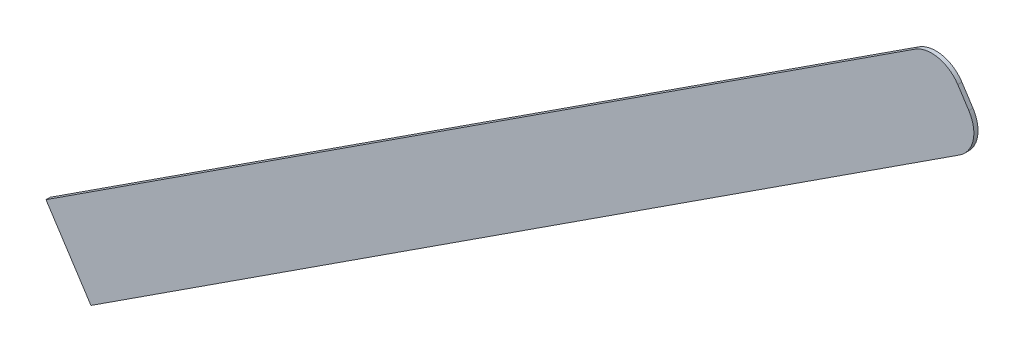
ISO-10303-21;
HEADER;
FILE_DESCRIPTION(('STEP AP214'),'2;1');
FILE_NAME('part.step','',(''),(''),'','','');
FILE_SCHEMA(('AUTOMOTIVE_DESIGN { 1 0 10303 214 1 1 1 1 }'));
ENDSEC;
DATA;
#1=APPLICATION_CONTEXT('core data for automotive mechanical design processes');
#2=APPLICATION_PROTOCOL_DEFINITION('international standard','automotive_design',2000,#1);
#3=PRODUCT_CONTEXT('',#1,'mechanical');
#4=PRODUCT('Part','Part','',(#3));
#5=PRODUCT_RELATED_PRODUCT_CATEGORY('part','',(#4));
#6=PRODUCT_DEFINITION_FORMATION('','',#4);
#7=PRODUCT_DEFINITION_CONTEXT('part definition',#1,'design');
#8=PRODUCT_DEFINITION('design','',#6,#7);
#9=PRODUCT_DEFINITION_SHAPE('','',#8);
#10=(LENGTH_UNIT() NAMED_UNIT(*) SI_UNIT(.MILLI.,.METRE.));
#11=(NAMED_UNIT(*) PLANE_ANGLE_UNIT() SI_UNIT($,.RADIAN.));
#12=(NAMED_UNIT(*) SI_UNIT($,.STERADIAN.) SOLID_ANGLE_UNIT());
#13=UNCERTAINTY_MEASURE_WITH_UNIT(LENGTH_MEASURE(1.E-05),#10,'distance_accuracy_value','');
#14=(GEOMETRIC_REPRESENTATION_CONTEXT(3) GLOBAL_UNCERTAINTY_ASSIGNED_CONTEXT((#13)) GLOBAL_UNIT_ASSIGNED_CONTEXT((#10,
#11,#12)) REPRESENTATION_CONTEXT('',''));
#15=CARTESIAN_POINT('',(0.,0.,0.));
#16=DIRECTION('',(0.,0.,1.));
#17=DIRECTION('',(1.,0.,0.));
#18=AXIS2_PLACEMENT_3D('',#15,#16,#17);
#19=CARTESIAN_POINT('',(79.4688535728897,52.7674489918808,2.));
#20=DIRECTION('',(0.,0.,-1.));
#21=DIRECTION('',(-1.,0.,0.));
#22=AXIS2_PLACEMENT_3D('',#19,#20,#21);
#23=CYLINDRICAL_SURFACE('',#22,15.);
#24=CARTESIAN_POINT('',(79.4688535728897,52.7674489918808,0.));
#25=DIRECTION('',(0.,0.,1.));
#26=DIRECTION('',(-1.,0.,0.));
#27=AXIS2_PLACEMENT_3D('',#24,#25,#26);
#28=CIRCLE('',#27,15.);
#29=CARTESIAN_POINT('',(92.0455078173995,60.9422742508116,0.));
#30=VERTEX_POINT('',#29);
#31=CARTESIAN_POINT('',(71.2940283139584,65.3441032363903,0.));
#32=VERTEX_POINT('',#31);
#33=EDGE_CURVE('E117',#30,#32,#28,.T.);
#34=ORIENTED_EDGE('',*,*,#33,.T.);
#35=DIRECTION('',(0.,0.,-1.));
#36=VECTOR('',#35,1.);
#37=CARTESIAN_POINT('',(71.2940283139584,65.3441032363903,2.));
#38=LINE('',#37,#36);
#39=CARTESIAN_POINT('',(71.2940283139584,65.3441032363903,2.));
#40=VERTEX_POINT('',#39);
#41=EDGE_CURVE('E11',#40,#32,#38,.T.);
#42=ORIENTED_EDGE('',*,*,#41,.F.);
#43=CARTESIAN_POINT('',(79.4688535728897,52.7674489918808,2.));
#44=DIRECTION('',(0.,0.,1.));
#45=DIRECTION('',(-1.,0.,0.));
#46=AXIS2_PLACEMENT_3D('',#43,#44,#45);
#47=CIRCLE('',#46,15.);
#48=CARTESIAN_POINT('',(92.0455078173995,60.9422742508116,2.));
#49=VERTEX_POINT('',#48);
#50=EDGE_CURVE('E127',#49,#40,#47,.T.);
#51=ORIENTED_EDGE('',*,*,#50,.F.);
#52=DIRECTION('',(0.,0.,-1.));
#53=VECTOR('',#52,1.);
#54=CARTESIAN_POINT('',(92.0455078173995,60.9422742508116,2.));
#55=LINE('',#54,#53);
#56=EDGE_CURVE('E113',#49,#30,#55,.T.);
#57=ORIENTED_EDGE('',*,*,#56,.T.);
#58=EDGE_LOOP('',(#34,#42,#51,#57));
#59=FACE_BOUND('',#58,.T.);
#60=ADVANCED_FACE('F33',(#59),#23,.T.);
#61=CARTESIAN_POINT('',(-347.92777983636,-207.150072061318,2.));
#62=DIRECTION('',(0.544988350595416,-0.838443616300636,0.));
#63=DIRECTION('',(0.838443616300636,0.544988350595416,0.));
#64=AXIS2_PLACEMENT_3D('',#61,#62,#63);
#65=PLANE('',#64);
#66=DIRECTION('',(-0.838443616300636,-0.544988350595416,0.));
#67=VECTOR('',#66,1.);
#68=CARTESIAN_POINT('',(-347.92777983636,-207.150072061318,0.));
#69=LINE('',#68,#67);
#70=CARTESIAN_POINT('',(-347.92777983636,-207.150072061318,0.));
#71=VERTEX_POINT('',#70);
#72=EDGE_CURVE('E120',#32,#71,#69,.T.);
#73=ORIENTED_EDGE('',*,*,#72,.T.);
#74=DIRECTION('',(0.,0.,-1.));
#75=VECTOR('',#74,1.);
#76=CARTESIAN_POINT('',(-347.92777983636,-207.150072061318,2.));
#77=LINE('',#76,#75);
#78=CARTESIAN_POINT('',(-347.92777983636,-207.150072061318,2.));
#79=VERTEX_POINT('',#78);
#80=EDGE_CURVE('E41',#79,#71,#77,.T.);
#81=ORIENTED_EDGE('',*,*,#80,.F.);
#82=DIRECTION('',(-0.838443616300636,-0.544988350595416,0.));
#83=VECTOR('',#82,1.);
#84=CARTESIAN_POINT('',(-347.92777983636,-207.150072061318,2.));
#85=LINE('',#84,#83);
#86=EDGE_CURVE('E86',#40,#79,#85,.T.);
#87=ORIENTED_EDGE('',*,*,#86,.F.);
#88=ORIENTED_EDGE('',*,*,#41,.T.);
#89=EDGE_LOOP('',(#73,#81,#87,#88));
#90=FACE_BOUND('',#89,.T.);
#91=ADVANCED_FACE('F151',(#90),#65,.F.);
#92=CARTESIAN_POINT('',(-347.92777983636,-207.150072061318,2.));
#93=DIRECTION('',(0.838443616300637,0.544988350595415,0.));
#94=DIRECTION('',(-0.544988350595415,0.838443616300637,0.));
#95=AXIS2_PLACEMENT_3D('',#92,#93,#94);
#96=PLANE('',#95);
#97=DIRECTION('',(0.544988350595415,-0.838443616300637,0.));
#98=VECTOR('',#97,1.);
#99=CARTESIAN_POINT('',(-347.92777983636,-207.150072061318,0.));
#100=LINE('',#99,#98);
#101=CARTESIAN_POINT('',(-326.237243482662,-240.520127990083,0.));
#102=VERTEX_POINT('',#101);
#103=EDGE_CURVE('E122',#71,#102,#100,.T.);
#104=ORIENTED_EDGE('',*,*,#103,.T.);
#105=DIRECTION('',(0.,0.,-1.));
#106=VECTOR('',#105,1.);
#107=CARTESIAN_POINT('',(-326.237243482662,-240.520127990083,2.));
#108=LINE('',#107,#106);
#109=CARTESIAN_POINT('',(-326.237243482662,-240.520127990083,2.));
#110=VERTEX_POINT('',#109);
#111=EDGE_CURVE('E108',#110,#102,#108,.T.);
#112=ORIENTED_EDGE('',*,*,#111,.F.);
#113=DIRECTION('',(0.544988350595415,-0.838443616300637,0.));
#114=VECTOR('',#113,1.);
#115=CARTESIAN_POINT('',(-347.92777983636,-207.150072061318,2.));
#116=LINE('',#115,#114);
#117=EDGE_CURVE('E99',#79,#110,#116,.T.);
#118=ORIENTED_EDGE('',*,*,#117,.F.);
#119=ORIENTED_EDGE('',*,*,#80,.T.);
#120=EDGE_LOOP('',(#104,#112,#118,#119));
#121=FACE_BOUND('',#120,.T.);
#122=ADVANCED_FACE('F133',(#121),#96,.F.);
#123=CARTESIAN_POINT('',(-326.237243482662,-240.520127990083,2.));
#124=DIRECTION('',(-0.544988350595416,0.838443616300636,0.));
#125=DIRECTION('',(-0.838443616300636,-0.544988350595416,0.));
#126=AXIS2_PLACEMENT_3D('',#123,#124,#125);
#127=PLANE('',#126);
#128=DIRECTION('',(0.838443616300636,0.544988350595416,0.));
#129=VECTOR('',#128,1.);
#130=CARTESIAN_POINT('',(-326.237243482662,-240.520127990083,0.));
#131=LINE('',#130,#129);
#132=CARTESIAN_POINT('',(92.9845646676559,31.974047307625,0.));
#133=VERTEX_POINT('',#132);
#134=EDGE_CURVE('E107',#102,#133,#131,.T.);
#135=ORIENTED_EDGE('',*,*,#134,.T.);
#136=DIRECTION('',(0.,0.,-1.));
#137=VECTOR('',#136,1.);
#138=CARTESIAN_POINT('',(92.9845646676559,31.974047307625,2.));
#139=LINE('',#138,#137);
#140=CARTESIAN_POINT('',(92.9845646676559,31.974047307625,2.));
#141=VERTEX_POINT('',#140);
#142=EDGE_CURVE('E104',#141,#133,#139,.T.);
#143=ORIENTED_EDGE('',*,*,#142,.F.);
#144=DIRECTION('',(0.838443616300636,0.544988350595416,0.));
#145=VECTOR('',#144,1.);
#146=CARTESIAN_POINT('',(-326.237243482662,-240.520127990083,2.));
#147=LINE('',#146,#145);
#148=EDGE_CURVE('E93',#110,#141,#147,.T.);
#149=ORIENTED_EDGE('',*,*,#148,.F.);
#150=ORIENTED_EDGE('',*,*,#111,.T.);
#151=EDGE_LOOP('',(#135,#143,#149,#150));
#152=FACE_BOUND('',#151,.T.);
#153=ADVANCED_FACE('F105',(#152),#127,.F.);
#154=CARTESIAN_POINT('',(84.8097394087247,44.5507015521346,2.));
#155=DIRECTION('',(0.,0.,-1.));
#156=DIRECTION('',(-1.,0.,0.));
#157=AXIS2_PLACEMENT_3D('',#154,#155,#156);
#158=CYLINDRICAL_SURFACE('',#157,15.);
#159=CARTESIAN_POINT('',(84.8097394087247,44.5507015521346,0.));
#160=DIRECTION('',(0.,0.,1.));
#161=DIRECTION('',(1.,0.,0.));
#162=AXIS2_PLACEMENT_3D('',#159,#160,#161);
#163=CIRCLE('',#162,15.);
#164=CARTESIAN_POINT('',(97.3863936532343,52.7255268110658,0.));
#165=VERTEX_POINT('',#164);
#166=EDGE_CURVE('E72',#133,#165,#163,.T.);
#167=ORIENTED_EDGE('',*,*,#166,.T.);
#168=DIRECTION('',(0.,0.,-1.));
#169=VECTOR('',#168,1.);
#170=CARTESIAN_POINT('',(97.3863936532343,52.7255268110658,2.));
#171=LINE('',#170,#169);
#172=CARTESIAN_POINT('',(97.3863936532343,52.7255268110658,2.));
#173=VERTEX_POINT('',#172);
#174=EDGE_CURVE('E109',#173,#165,#171,.T.);
#175=ORIENTED_EDGE('',*,*,#174,.F.);
#176=CARTESIAN_POINT('',(84.8097394087247,44.5507015521346,2.));
#177=DIRECTION('',(0.,0.,1.));
#178=DIRECTION('',(1.,0.,0.));
#179=AXIS2_PLACEMENT_3D('',#176,#177,#178);
#180=CIRCLE('',#179,15.);
#181=EDGE_CURVE('E97',#141,#173,#180,.T.);
#182=ORIENTED_EDGE('',*,*,#181,.F.);
#183=ORIENTED_EDGE('',*,*,#142,.T.);
#184=EDGE_LOOP('',(#167,#175,#182,#183));
#185=FACE_BOUND('',#184,.T.);
#186=ADVANCED_FACE('F111',(#185),#158,.T.);
#187=CARTESIAN_POINT('',(92.0455078173995,60.9422742508116,2.));
#188=DIRECTION('',(-0.838443616300637,-0.544988350595414,0.));
#189=DIRECTION('',(0.544988350595414,-0.838443616300637,0.));
#190=AXIS2_PLACEMENT_3D('',#187,#188,#189);
#191=PLANE('',#190);
#192=DIRECTION('',(-0.544988350595414,0.838443616300637,0.));
#193=VECTOR('',#192,1.);
#194=CARTESIAN_POINT('',(92.0455078173995,60.9422742508116,0.));
#195=LINE('',#194,#193);
#196=EDGE_CURVE('E78',#165,#30,#195,.T.);
#197=ORIENTED_EDGE('',*,*,#196,.T.);
#198=ORIENTED_EDGE('',*,*,#56,.F.);
#199=DIRECTION('',(-0.544988350595414,0.838443616300637,0.));
#200=VECTOR('',#199,1.);
#201=CARTESIAN_POINT('',(92.0455078173995,60.9422742508116,2.));
#202=LINE('',#201,#200);
#203=EDGE_CURVE('E49',#173,#49,#202,.T.);
#204=ORIENTED_EDGE('',*,*,#203,.F.);
#205=ORIENTED_EDGE('',*,*,#174,.T.);
#206=EDGE_LOOP('',(#197,#198,#204,#205));
#207=FACE_BOUND('',#206,.T.);
#208=ADVANCED_FACE('F140',(#207),#191,.F.);
#209=CARTESIAN_POINT('',(79.4688535728897,52.7674489918808,2.));
#210=DIRECTION('',(0.,0.,-1.));
#211=DIRECTION('',(-1.,0.,0.));
#212=AXIS2_PLACEMENT_3D('',#209,#210,#211);
#213=PLANE('',#212);
#214=ORIENTED_EDGE('',*,*,#50,.T.);
#215=ORIENTED_EDGE('',*,*,#86,.T.);
#216=ORIENTED_EDGE('',*,*,#117,.T.);
#217=ORIENTED_EDGE('',*,*,#148,.T.);
#218=ORIENTED_EDGE('',*,*,#181,.T.);
#219=ORIENTED_EDGE('',*,*,#203,.T.);
#220=EDGE_LOOP('',(#214,#215,#216,#217,#218,#219));
#221=FACE_BOUND('',#220,.T.);
#222=ADVANCED_FACE('F95',(#221),#213,.F.);
#223=CARTESIAN_POINT('',(79.4688535728897,52.7674489918808,0.));
#224=DIRECTION('',(0.,0.,-1.));
#225=DIRECTION('',(-1.,0.,0.));
#226=AXIS2_PLACEMENT_3D('',#223,#224,#225);
#227=PLANE('',#226);
#228=ORIENTED_EDGE('',*,*,#33,.F.);
#229=ORIENTED_EDGE('',*,*,#196,.F.);
#230=ORIENTED_EDGE('',*,*,#166,.F.);
#231=ORIENTED_EDGE('',*,*,#134,.F.);
#232=ORIENTED_EDGE('',*,*,#103,.F.);
#233=ORIENTED_EDGE('',*,*,#72,.F.);
#234=EDGE_LOOP('',(#228,#229,#230,#231,#232,#233));
#235=FACE_BOUND('',#234,.T.);
#236=ADVANCED_FACE('F136',(#235),#227,.T.);
#237=CLOSED_SHELL('',(#60,#91,#122,#153,#186,#208,#222,#236));
#238=MANIFOLD_SOLID_BREP('B2',#237);
#239=ADVANCED_BREP_SHAPE_REPRESENTATION('',(#18,#238),#14);
#240=SHAPE_DEFINITION_REPRESENTATION(#9,#239);
ENDSEC;
END-ISO-10303-21;
